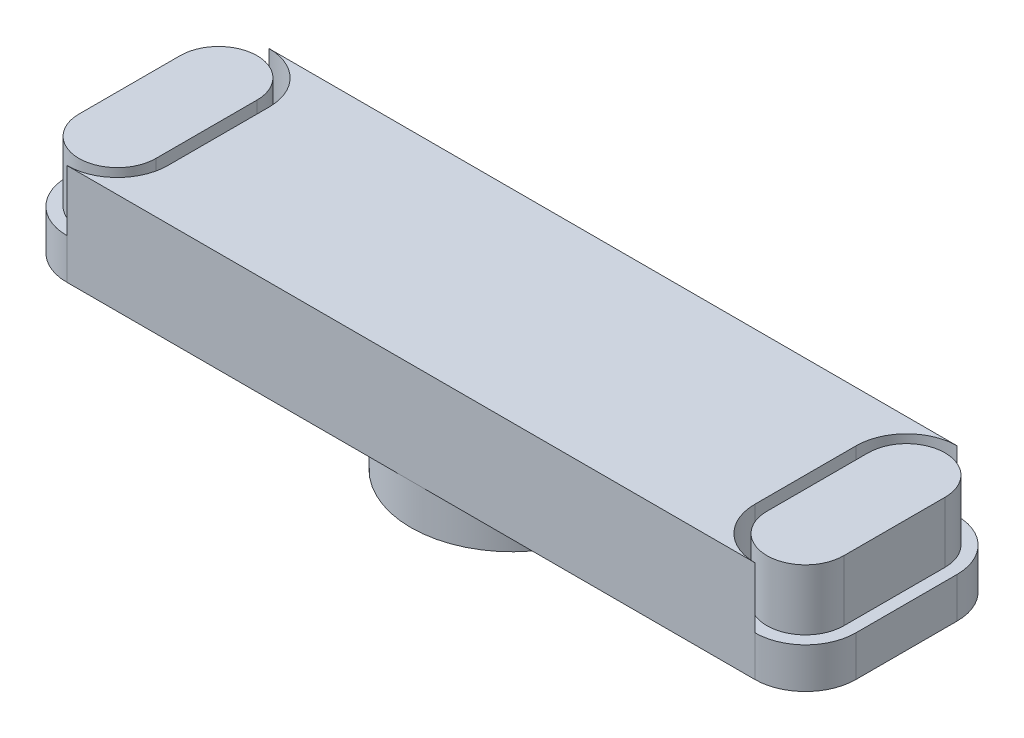
ISO-10303-21;
HEADER;
FILE_DESCRIPTION(('STEP AP214'),'2;1');
FILE_NAME('part.step','',(''),(''),'','','');
FILE_SCHEMA(('AUTOMOTIVE_DESIGN { 1 0 10303 214 1 1 1 1 }'));
ENDSEC;
DATA;
#1=APPLICATION_CONTEXT('core data for automotive mechanical design processes');
#2=APPLICATION_PROTOCOL_DEFINITION('international standard','automotive_design',2000,#1);
#3=PRODUCT_CONTEXT('',#1,'mechanical');
#4=PRODUCT('Part','Part','',(#3));
#5=PRODUCT_RELATED_PRODUCT_CATEGORY('part','',(#4));
#6=PRODUCT_DEFINITION_FORMATION('','',#4);
#7=PRODUCT_DEFINITION_CONTEXT('part definition',#1,'design');
#8=PRODUCT_DEFINITION('design','',#6,#7);
#9=PRODUCT_DEFINITION_SHAPE('','',#8);
#10=(LENGTH_UNIT() NAMED_UNIT(*) SI_UNIT(.MILLI.,.METRE.));
#11=(NAMED_UNIT(*) PLANE_ANGLE_UNIT() SI_UNIT($,.RADIAN.));
#12=(NAMED_UNIT(*) SI_UNIT($,.STERADIAN.) SOLID_ANGLE_UNIT());
#13=UNCERTAINTY_MEASURE_WITH_UNIT(LENGTH_MEASURE(1.E-05),#10,'distance_accuracy_value','');
#14=(GEOMETRIC_REPRESENTATION_CONTEXT(3) GLOBAL_UNCERTAINTY_ASSIGNED_CONTEXT((#13)) GLOBAL_UNIT_ASSIGNED_CONTEXT((#10,
#11,#12)) REPRESENTATION_CONTEXT('',''));
#15=CARTESIAN_POINT('',(0.,0.,0.));
#16=DIRECTION('',(0.,0.,1.));
#17=DIRECTION('',(1.,0.,0.));
#18=AXIS2_PLACEMENT_3D('',#15,#16,#17);
#19=CARTESIAN_POINT('',(0.,0.,0.));
#20=DIRECTION('',(0.,1.,0.));
#21=DIRECTION('',(0.,0.,1.));
#22=AXIS2_PLACEMENT_3D('',#19,#20,#21);
#23=PLANE('',#22);
#24=DIRECTION('',(0.,0.,1.));
#25=VECTOR('',#24,1.);
#26=CARTESIAN_POINT('',(-14.5,0.,0.));
#27=LINE('',#26,#25);
#28=CARTESIAN_POINT('',(-14.5,0.,-2.5));
#29=VERTEX_POINT('',#28);
#30=CARTESIAN_POINT('',(-14.5,0.,2.5));
#31=VERTEX_POINT('',#30);
#32=EDGE_CURVE('E204',#29,#31,#27,.T.);
#33=ORIENTED_EDGE('',*,*,#32,.T.);
#34=CARTESIAN_POINT('',(-17.,0.,2.49999999999999));
#35=DIRECTION('',(0.,1.,0.));
#36=DIRECTION('',(0.,0.,1.));
#37=AXIS2_PLACEMENT_3D('',#34,#35,#36);
#38=CIRCLE('',#37,2.50000000000001);
#39=CARTESIAN_POINT('',(-17.,0.,5.));
#40=VERTEX_POINT('',#39);
#41=EDGE_CURVE('E252',#31,#40,#38,.F.);
#42=ORIENTED_EDGE('',*,*,#41,.T.);
#43=DIRECTION('',(1.,0.,0.));
#44=VECTOR('',#43,1.);
#45=CARTESIAN_POINT('',(0.,0.,5.));
#46=LINE('',#45,#44);
#47=CARTESIAN_POINT('',(17.,0.,5.));
#48=VERTEX_POINT('',#47);
#49=EDGE_CURVE('E413',#40,#48,#46,.T.);
#50=ORIENTED_EDGE('',*,*,#49,.T.);
#51=CARTESIAN_POINT('',(17.,0.,2.5));
#52=DIRECTION('',(0.,1.,0.));
#53=DIRECTION('',(0.,0.,1.));
#54=AXIS2_PLACEMENT_3D('',#51,#52,#53);
#55=CIRCLE('',#54,2.50000000000001);
#56=CARTESIAN_POINT('',(14.5,0.,2.5));
#57=VERTEX_POINT('',#56);
#58=EDGE_CURVE('E50',#48,#57,#55,.F.);
#59=ORIENTED_EDGE('',*,*,#58,.T.);
#60=DIRECTION('',(0.,0.,1.));
#61=VECTOR('',#60,1.);
#62=CARTESIAN_POINT('',(14.5,0.,0.));
#63=LINE('',#62,#61);
#64=CARTESIAN_POINT('',(14.5,0.,-2.49999999999999));
#65=VERTEX_POINT('',#64);
#66=EDGE_CURVE('E272',#65,#57,#63,.T.);
#67=ORIENTED_EDGE('',*,*,#66,.F.);
#68=CARTESIAN_POINT('',(17.,0.,-2.49999999999999));
#69=DIRECTION('',(0.,1.,0.));
#70=DIRECTION('',(0.,0.,1.));
#71=AXIS2_PLACEMENT_3D('',#68,#69,#70);
#72=CIRCLE('',#71,2.50000000000001);
#73=CARTESIAN_POINT('',(17.,0.,-5.));
#74=VERTEX_POINT('',#73);
#75=EDGE_CURVE('E378',#74,#65,#72,.T.);
#76=ORIENTED_EDGE('',*,*,#75,.F.);
#77=DIRECTION('',(1.,0.,0.));
#78=VECTOR('',#77,1.);
#79=CARTESIAN_POINT('',(0.,0.,-5.));
#80=LINE('',#79,#78);
#81=CARTESIAN_POINT('',(-17.,0.,-4.99999999999999));
#82=VERTEX_POINT('',#81);
#83=EDGE_CURVE('E384',#82,#74,#80,.T.);
#84=ORIENTED_EDGE('',*,*,#83,.F.);
#85=CARTESIAN_POINT('',(-17.,0.,-2.5));
#86=DIRECTION('',(0.,1.,0.));
#87=DIRECTION('',(0.,0.,1.));
#88=AXIS2_PLACEMENT_3D('',#85,#86,#87);
#89=CIRCLE('',#88,2.5);
#90=EDGE_CURVE('E249',#29,#82,#89,.T.);
#91=ORIENTED_EDGE('',*,*,#90,.F.);
#92=EDGE_LOOP('',(#33,#42,#50,#59,#67,#76,#84,#91));
#93=FACE_BOUND('',#92,.T.);
#94=ADVANCED_FACE('F41',(#93),#23,.T.);
#95=CARTESIAN_POINT('',(-19.5,-5.,0.));
#96=DIRECTION('',(1.,0.,0.));
#97=DIRECTION('',(0.,0.,-1.));
#98=AXIS2_PLACEMENT_3D('',#95,#96,#97);
#99=PLANE('',#98);
#100=DIRECTION('',(0.,0.,-1.));
#101=VECTOR('',#100,1.);
#102=CARTESIAN_POINT('',(-19.5,-3.,0.));
#103=LINE('',#102,#101);
#104=CARTESIAN_POINT('',(-19.5,-3.,2.5));
#105=VERTEX_POINT('',#104);
#106=CARTESIAN_POINT('',(-19.5,-3.,-2.5));
#107=VERTEX_POINT('',#106);
#108=EDGE_CURVE('E64',#105,#107,#103,.T.);
#109=ORIENTED_EDGE('',*,*,#108,.T.);
#110=DIRECTION('',(0.,1.,0.));
#111=VECTOR('',#110,1.);
#112=CARTESIAN_POINT('',(-19.5,-5.,-2.5));
#113=LINE('',#112,#111);
#114=CARTESIAN_POINT('',(-19.5,-5.,-2.5));
#115=VERTEX_POINT('',#114);
#116=EDGE_CURVE('E379',#115,#107,#113,.T.);
#117=ORIENTED_EDGE('',*,*,#116,.F.);
#118=DIRECTION('',(0.,0.,-1.));
#119=VECTOR('',#118,1.);
#120=CARTESIAN_POINT('',(-19.5,-5.,0.));
#121=LINE('',#120,#119);
#122=CARTESIAN_POINT('',(-19.5,-5.,2.5));
#123=VERTEX_POINT('',#122);
#124=EDGE_CURVE('E380',#123,#115,#121,.T.);
#125=ORIENTED_EDGE('',*,*,#124,.F.);
#126=DIRECTION('',(0.,1.,0.));
#127=VECTOR('',#126,1.);
#128=CARTESIAN_POINT('',(-19.5,-5.,2.5));
#129=LINE('',#128,#127);
#130=EDGE_CURVE('E412',#123,#105,#129,.T.);
#131=ORIENTED_EDGE('',*,*,#130,.T.);
#132=EDGE_LOOP('',(#109,#117,#125,#131));
#133=FACE_BOUND('',#132,.T.);
#134=ADVANCED_FACE('F43',(#133),#99,.F.);
#135=CARTESIAN_POINT('',(-17.,-5.,-2.5));
#136=DIRECTION('',(0.,1.,0.));
#137=DIRECTION('',(0.,0.,1.));
#138=AXIS2_PLACEMENT_3D('',#135,#136,#137);
#139=CYLINDRICAL_SURFACE('',#138,2.5);
#140=ORIENTED_EDGE('',*,*,#116,.T.);
#141=CARTESIAN_POINT('',(-17.,-3.,-2.5));
#142=DIRECTION('',(0.,1.,0.));
#143=DIRECTION('',(0.,0.,1.));
#144=AXIS2_PLACEMENT_3D('',#141,#142,#143);
#145=CIRCLE('',#144,2.5);
#146=CARTESIAN_POINT('',(-17.,-3.,-4.99999999999999));
#147=VERTEX_POINT('',#146);
#148=EDGE_CURVE('E220',#147,#107,#145,.T.);
#149=ORIENTED_EDGE('',*,*,#148,.F.);
#150=DIRECTION('',(0.,1.,0.));
#151=VECTOR('',#150,1.);
#152=CARTESIAN_POINT('',(-17.,-5.,-4.99999999999999));
#153=LINE('',#152,#151);
#154=CARTESIAN_POINT('',(-17.,-5.,-4.99999999999999));
#155=VERTEX_POINT('',#154);
#156=EDGE_CURVE('E423',#155,#147,#153,.T.);
#157=ORIENTED_EDGE('',*,*,#156,.F.);
#158=CARTESIAN_POINT('',(-17.,-5.,-2.5));
#159=DIRECTION('',(0.,1.,0.));
#160=DIRECTION('',(0.,0.,1.));
#161=AXIS2_PLACEMENT_3D('',#158,#159,#160);
#162=CIRCLE('',#161,2.5);
#163=EDGE_CURVE('E408',#155,#115,#162,.T.);
#164=ORIENTED_EDGE('',*,*,#163,.T.);
#165=EDGE_LOOP('',(#140,#149,#157,#164));
#166=FACE_BOUND('',#165,.T.);
#167=ADVANCED_FACE('F524',(#166),#139,.T.);
#168=CARTESIAN_POINT('',(-17.,-5.,2.49999999999999));
#169=DIRECTION('',(0.,1.,0.));
#170=DIRECTION('',(0.,0.,1.));
#171=AXIS2_PLACEMENT_3D('',#168,#169,#170);
#172=CYLINDRICAL_SURFACE('',#171,2.50000000000001);
#173=CARTESIAN_POINT('',(-17.,-3.,2.49999999999999));
#174=DIRECTION('',(0.,1.,0.));
#175=DIRECTION('',(0.,0.,1.));
#176=AXIS2_PLACEMENT_3D('',#173,#174,#175);
#177=CIRCLE('',#176,2.50000000000001);
#178=CARTESIAN_POINT('',(-17.,-3.,5.));
#179=VERTEX_POINT('',#178);
#180=EDGE_CURVE('E11',#105,#179,#177,.T.);
#181=ORIENTED_EDGE('',*,*,#180,.F.);
#182=ORIENTED_EDGE('',*,*,#130,.F.);
#183=CARTESIAN_POINT('',(-17.,-5.,2.49999999999999));
#184=DIRECTION('',(0.,1.,0.));
#185=DIRECTION('',(0.,0.,1.));
#186=AXIS2_PLACEMENT_3D('',#183,#184,#185);
#187=CIRCLE('',#186,2.50000000000001);
#188=CARTESIAN_POINT('',(-17.,-5.,5.00000000000001));
#189=VERTEX_POINT('',#188);
#190=EDGE_CURVE('E383',#189,#123,#187,.F.);
#191=ORIENTED_EDGE('',*,*,#190,.F.);
#192=DIRECTION('',(0.,1.,0.));
#193=VECTOR('',#192,1.);
#194=CARTESIAN_POINT('',(-17.,-5.,5.00000000000001));
#195=LINE('',#194,#193);
#196=EDGE_CURVE('E443',#189,#179,#195,.T.);
#197=ORIENTED_EDGE('',*,*,#196,.T.);
#198=EDGE_LOOP('',(#181,#182,#191,#197));
#199=FACE_BOUND('',#198,.T.);
#200=ADVANCED_FACE('F597',(#199),#172,.T.);
#201=CARTESIAN_POINT('',(17.,-5.,-2.5));
#202=DIRECTION('',(0.,1.,0.));
#203=DIRECTION('',(0.,0.,1.));
#204=AXIS2_PLACEMENT_3D('',#201,#202,#203);
#205=CYLINDRICAL_SURFACE('',#204,2.50000000000001);
#206=CARTESIAN_POINT('',(17.,-3.,-2.49999999999999));
#207=DIRECTION('',(0.,1.,0.));
#208=DIRECTION('',(0.,0.,1.));
#209=AXIS2_PLACEMENT_3D('',#206,#207,#208);
#210=CIRCLE('',#209,2.50000000000001);
#211=CARTESIAN_POINT('',(19.5,-3.,-2.49999999999999));
#212=VERTEX_POINT('',#211);
#213=CARTESIAN_POINT('',(17.,-3.,-5.));
#214=VERTEX_POINT('',#213);
#215=EDGE_CURVE('E293',#212,#214,#210,.T.);
#216=ORIENTED_EDGE('',*,*,#215,.F.);
#217=DIRECTION('',(0.,1.,0.));
#218=VECTOR('',#217,1.);
#219=CARTESIAN_POINT('',(19.5,-5.,-2.49999999999999));
#220=LINE('',#219,#218);
#221=CARTESIAN_POINT('',(19.5,-5.,-2.49999999999999));
#222=VERTEX_POINT('',#221);
#223=EDGE_CURVE('E431',#222,#212,#220,.T.);
#224=ORIENTED_EDGE('',*,*,#223,.F.);
#225=CARTESIAN_POINT('',(17.,-5.,-2.5));
#226=DIRECTION('',(0.,1.,0.));
#227=DIRECTION('',(0.,0.,1.));
#228=AXIS2_PLACEMENT_3D('',#225,#226,#227);
#229=CIRCLE('',#228,2.50000000000001);
#230=CARTESIAN_POINT('',(17.,-5.,-5.));
#231=VERTEX_POINT('',#230);
#232=EDGE_CURVE('E400',#231,#222,#229,.F.);
#233=ORIENTED_EDGE('',*,*,#232,.F.);
#234=DIRECTION('',(0.,1.,0.));
#235=VECTOR('',#234,1.);
#236=CARTESIAN_POINT('',(17.,-5.,-5.));
#237=LINE('',#236,#235);
#238=EDGE_CURVE('E427',#231,#214,#237,.T.);
#239=ORIENTED_EDGE('',*,*,#238,.T.);
#240=EDGE_LOOP('',(#216,#224,#233,#239));
#241=FACE_BOUND('',#240,.T.);
#242=ADVANCED_FACE('F482',(#241),#205,.T.);
#243=CARTESIAN_POINT('',(19.5,-5.,0.));
#244=DIRECTION('',(1.,0.,0.));
#245=DIRECTION('',(0.,0.,-1.));
#246=AXIS2_PLACEMENT_3D('',#243,#244,#245);
#247=PLANE('',#246);
#248=ORIENTED_EDGE('',*,*,#223,.T.);
#249=DIRECTION('',(0.,0.,-1.));
#250=VECTOR('',#249,1.);
#251=CARTESIAN_POINT('',(19.5,-3.,0.));
#252=LINE('',#251,#250);
#253=CARTESIAN_POINT('',(19.5,-3.,2.5));
#254=VERTEX_POINT('',#253);
#255=EDGE_CURVE('E288',#254,#212,#252,.T.);
#256=ORIENTED_EDGE('',*,*,#255,.F.);
#257=DIRECTION('',(0.,1.,0.));
#258=VECTOR('',#257,1.);
#259=CARTESIAN_POINT('',(19.5,-5.,2.5));
#260=LINE('',#259,#258);
#261=CARTESIAN_POINT('',(19.5,-5.,2.5));
#262=VERTEX_POINT('',#261);
#263=EDGE_CURVE('E435',#262,#254,#260,.T.);
#264=ORIENTED_EDGE('',*,*,#263,.F.);
#265=DIRECTION('',(0.,0.,-1.));
#266=VECTOR('',#265,1.);
#267=CARTESIAN_POINT('',(19.5,-5.,0.));
#268=LINE('',#267,#266);
#269=EDGE_CURVE('E396',#262,#222,#268,.T.);
#270=ORIENTED_EDGE('',*,*,#269,.T.);
#271=EDGE_LOOP('',(#248,#256,#264,#270));
#272=FACE_BOUND('',#271,.T.);
#273=ADVANCED_FACE('F478',(#272),#247,.T.);
#274=CARTESIAN_POINT('',(17.,-5.,2.5));
#275=DIRECTION('',(0.,1.,0.));
#276=DIRECTION('',(0.,0.,1.));
#277=AXIS2_PLACEMENT_3D('',#274,#275,#276);
#278=CYLINDRICAL_SURFACE('',#277,2.50000000000001);
#279=CARTESIAN_POINT('',(17.,-3.,2.5));
#280=DIRECTION('',(0.,1.,0.));
#281=DIRECTION('',(0.,0.,1.));
#282=AXIS2_PLACEMENT_3D('',#279,#280,#281);
#283=CIRCLE('',#282,2.50000000000001);
#284=CARTESIAN_POINT('',(17.,-3.,5.));
#285=VERTEX_POINT('',#284);
#286=EDGE_CURVE('E284',#254,#285,#283,.F.);
#287=ORIENTED_EDGE('',*,*,#286,.T.);
#288=DIRECTION('',(0.,1.,0.));
#289=VECTOR('',#288,1.);
#290=CARTESIAN_POINT('',(17.,-5.,5.));
#291=LINE('',#290,#289);
#292=CARTESIAN_POINT('',(17.,-5.,5.));
#293=VERTEX_POINT('',#292);
#294=EDGE_CURVE('E439',#293,#285,#291,.T.);
#295=ORIENTED_EDGE('',*,*,#294,.F.);
#296=CARTESIAN_POINT('',(17.,-5.,2.5));
#297=DIRECTION('',(0.,1.,0.));
#298=DIRECTION('',(0.,0.,1.));
#299=AXIS2_PLACEMENT_3D('',#296,#297,#298);
#300=CIRCLE('',#299,2.50000000000001);
#301=EDGE_CURVE('E392',#262,#293,#300,.F.);
#302=ORIENTED_EDGE('',*,*,#301,.F.);
#303=ORIENTED_EDGE('',*,*,#263,.T.);
#304=EDGE_LOOP('',(#287,#295,#302,#303));
#305=FACE_BOUND('',#304,.T.);
#306=ADVANCED_FACE('F470',(#305),#278,.T.);
#307=CARTESIAN_POINT('',(0.,-5.,0.));
#308=DIRECTION('',(0.,1.,0.));
#309=DIRECTION('',(0.,0.,1.));
#310=AXIS2_PLACEMENT_3D('',#307,#308,#309);
#311=PLANE('',#310);
#312=DIRECTION('',(1.,0.,0.));
#313=VECTOR('',#312,1.);
#314=CARTESIAN_POINT('',(0.,-5.,5.));
#315=LINE('',#314,#313);
#316=CARTESIAN_POINT('',(0.,-5.,5.));
#317=VERTEX_POINT('',#316);
#318=EDGE_CURVE('E387',#317,#293,#315,.T.);
#319=ORIENTED_EDGE('',*,*,#318,.F.);
#320=CARTESIAN_POINT('',(0.,-5.,0.));
#321=DIRECTION('',(0.,1.,0.));
#322=DIRECTION('',(0.,0.,1.));
#323=AXIS2_PLACEMENT_3D('',#320,#321,#322);
#324=CIRCLE('',#323,5.);
#325=CARTESIAN_POINT('',(0.,-5.,-5.));
#326=VERTEX_POINT('',#325);
#327=EDGE_CURVE('E373',#317,#326,#324,.T.);
#328=ORIENTED_EDGE('',*,*,#327,.T.);
#329=DIRECTION('',(1.,0.,0.));
#330=VECTOR('',#329,1.);
#331=CARTESIAN_POINT('',(0.,-5.,-5.));
#332=LINE('',#331,#330);
#333=EDGE_CURVE('E403',#326,#231,#332,.T.);
#334=ORIENTED_EDGE('',*,*,#333,.T.);
#335=ORIENTED_EDGE('',*,*,#232,.T.);
#336=ORIENTED_EDGE('',*,*,#269,.F.);
#337=ORIENTED_EDGE('',*,*,#301,.T.);
#338=EDGE_LOOP('',(#319,#328,#334,#335,#336,#337));
#339=FACE_BOUND('',#338,.T.);
#340=ADVANCED_FACE('F614',(#339),#311,.F.);
#341=CARTESIAN_POINT('',(0.,-5.,-5.));
#342=DIRECTION('',(0.,0.,1.));
#343=DIRECTION('',(1.,0.,0.));
#344=AXIS2_PLACEMENT_3D('',#341,#342,#343);
#345=PLANE('',#344);
#346=ORIENTED_EDGE('',*,*,#333,.F.);
#347=EDGE_CURVE('E404',#155,#326,#332,.T.);
#348=ORIENTED_EDGE('',*,*,#347,.F.);
#349=ORIENTED_EDGE('',*,*,#156,.T.);
#350=EDGE_CURVE('E225',#147,#82,#153,.T.);
#351=ORIENTED_EDGE('',*,*,#350,.T.);
#352=ORIENTED_EDGE('',*,*,#83,.T.);
#353=DIRECTION('',(0.,1.,0.));
#354=VECTOR('',#353,1.);
#355=CARTESIAN_POINT('',(17.,-3.,-5.));
#356=LINE('',#355,#354);
#357=EDGE_CURVE('E338',#214,#74,#356,.T.);
#358=ORIENTED_EDGE('',*,*,#357,.F.);
#359=ORIENTED_EDGE('',*,*,#238,.F.);
#360=EDGE_LOOP('',(#346,#348,#349,#351,#352,#358,#359));
#361=FACE_BOUND('',#360,.T.);
#362=ADVANCED_FACE('F488',(#361),#345,.F.);
#363=CARTESIAN_POINT('',(0.,-5.,5.));
#364=DIRECTION('',(0.,0.,1.));
#365=DIRECTION('',(1.,0.,0.));
#366=AXIS2_PLACEMENT_3D('',#363,#364,#365);
#367=PLANE('',#366);
#368=ORIENTED_EDGE('',*,*,#294,.T.);
#369=DIRECTION('',(0.,1.,0.));
#370=VECTOR('',#369,1.);
#371=CARTESIAN_POINT('',(17.,-3.,5.));
#372=LINE('',#371,#370);
#373=EDGE_CURVE('E358',#48,#285,#372,.F.);
#374=ORIENTED_EDGE('',*,*,#373,.F.);
#375=ORIENTED_EDGE('',*,*,#49,.F.);
#376=EDGE_CURVE('E447',#179,#40,#195,.T.);
#377=ORIENTED_EDGE('',*,*,#376,.F.);
#378=ORIENTED_EDGE('',*,*,#196,.F.);
#379=EDGE_CURVE('E388',#189,#317,#315,.T.);
#380=ORIENTED_EDGE('',*,*,#379,.T.);
#381=ORIENTED_EDGE('',*,*,#318,.T.);
#382=EDGE_LOOP('',(#368,#374,#375,#377,#378,#380,#381));
#383=FACE_BOUND('',#382,.T.);
#384=ADVANCED_FACE('F464',(#383),#367,.T.);
#385=ORIENTED_EDGE('',*,*,#347,.T.);
#386=EDGE_CURVE('E369',#326,#317,#324,.T.);
#387=ORIENTED_EDGE('',*,*,#386,.T.);
#388=ORIENTED_EDGE('',*,*,#379,.F.);
#389=ORIENTED_EDGE('',*,*,#190,.T.);
#390=ORIENTED_EDGE('',*,*,#124,.T.);
#391=ORIENTED_EDGE('',*,*,#163,.F.);
#392=EDGE_LOOP('',(#385,#387,#388,#389,#390,#391));
#393=FACE_BOUND('',#392,.T.);
#394=ADVANCED_FACE('F626',(#393),#311,.F.);
#395=CARTESIAN_POINT('',(0.,-7.,0.));
#396=DIRECTION('',(0.,1.,0.));
#397=DIRECTION('',(0.,0.,1.));
#398=AXIS2_PLACEMENT_3D('',#395,#396,#397);
#399=CYLINDRICAL_SURFACE('',#398,3.5);
#400=CARTESIAN_POINT('',(0.,-7.,0.));
#401=DIRECTION('',(0.,1.,0.));
#402=DIRECTION('',(0.,0.,1.));
#403=AXIS2_PLACEMENT_3D('',#400,#401,#402);
#404=CIRCLE('',#403,3.5);
#405=CARTESIAN_POINT('',(0.,-7.,3.5));
#406=VERTEX_POINT('',#405);
#407=EDGE_CURVE('E361',#406,#406,#404,.T.);
#408=ORIENTED_EDGE('',*,*,#407,.F.);
#409=EDGE_LOOP('',(#408));
#410=FACE_BOUND('',#409,.T.);
#411=CARTESIAN_POINT('',(0.,-5.,0.));
#412=DIRECTION('',(0.,1.,0.));
#413=DIRECTION('',(0.,0.,1.));
#414=AXIS2_PLACEMENT_3D('',#411,#412,#413);
#415=CIRCLE('',#414,3.5);
#416=CARTESIAN_POINT('',(0.,-5.,3.5));
#417=VERTEX_POINT('',#416);
#418=EDGE_CURVE('E374',#417,#417,#415,.T.);
#419=ORIENTED_EDGE('',*,*,#418,.T.);
#420=EDGE_LOOP('',(#419));
#421=FACE_BOUND('',#420,.T.);
#422=ADVANCED_FACE('F839',(#410,#421),#399,.F.);
#423=CARTESIAN_POINT('',(0.,-7.,0.));
#424=DIRECTION('',(0.,1.,0.));
#425=DIRECTION('',(0.,0.,1.));
#426=AXIS2_PLACEMENT_3D('',#423,#424,#425);
#427=CYLINDRICAL_SURFACE('',#426,5.);
#428=CARTESIAN_POINT('',(0.,-7.,0.));
#429=DIRECTION('',(0.,1.,0.));
#430=DIRECTION('',(0.,0.,1.));
#431=AXIS2_PLACEMENT_3D('',#428,#429,#430);
#432=CIRCLE('',#431,5.);
#433=CARTESIAN_POINT('',(0.,-7.,5.));
#434=VERTEX_POINT('',#433);
#435=EDGE_CURVE('E365',#434,#434,#432,.T.);
#436=ORIENTED_EDGE('',*,*,#435,.T.);
#437=EDGE_LOOP('',(#436));
#438=FACE_BOUND('',#437,.T.);
#439=ORIENTED_EDGE('',*,*,#327,.F.);
#440=ORIENTED_EDGE('',*,*,#386,.F.);
#441=EDGE_LOOP('',(#439,#440));
#442=FACE_BOUND('',#441,.T.);
#443=ADVANCED_FACE('F836',(#438,#442),#427,.T.);
#444=CARTESIAN_POINT('',(0.,-7.,0.));
#445=DIRECTION('',(0.,1.,0.));
#446=DIRECTION('',(0.,0.,1.));
#447=AXIS2_PLACEMENT_3D('',#444,#445,#446);
#448=PLANE('',#447);
#449=ORIENTED_EDGE('',*,*,#407,.T.);
#450=EDGE_LOOP('',(#449));
#451=FACE_BOUND('',#450,.T.);
#452=ORIENTED_EDGE('',*,*,#435,.F.);
#453=EDGE_LOOP('',(#452));
#454=FACE_BOUND('',#453,.T.);
#455=ADVANCED_FACE('F838',(#451,#454),#448,.F.);
#456=ORIENTED_EDGE('',*,*,#418,.F.);
#457=EDGE_LOOP('',(#456));
#458=FACE_BOUND('',#457,.T.);
#459=ADVANCED_FACE('F846',(#458),#311,.F.);
#460=CARTESIAN_POINT('',(17.,-3.,2.5));
#461=DIRECTION('',(0.,1.,0.));
#462=DIRECTION('',(0.,0.,1.));
#463=AXIS2_PLACEMENT_3D('',#460,#461,#462);
#464=CYLINDRICAL_SURFACE('',#463,2.50000000000001);
#465=ORIENTED_EDGE('',*,*,#373,.T.);
#466=CARTESIAN_POINT('',(14.5,-3.,2.5));
#467=VERTEX_POINT('',#466);
#468=EDGE_CURVE('E289',#285,#467,#283,.F.);
#469=ORIENTED_EDGE('',*,*,#468,.T.);
#470=DIRECTION('',(0.,1.,0.));
#471=VECTOR('',#470,1.);
#472=CARTESIAN_POINT('',(14.5,-3.,2.5));
#473=LINE('',#472,#471);
#474=EDGE_CURVE('E350',#467,#57,#473,.T.);
#475=ORIENTED_EDGE('',*,*,#474,.T.);
#476=ORIENTED_EDGE('',*,*,#58,.F.);
#477=EDGE_LOOP('',(#465,#469,#475,#476));
#478=FACE_BOUND('',#477,.T.);
#479=ADVANCED_FACE('F460',(#478),#464,.F.);
#480=CARTESIAN_POINT('',(18.9,-3.,0.));
#481=DIRECTION('',(-1.,0.,0.));
#482=DIRECTION('',(0.,0.,1.));
#483=AXIS2_PLACEMENT_3D('',#480,#481,#482);
#484=PLANE('',#483);
#485=DIRECTION('',(0.,0.,1.));
#486=VECTOR('',#485,1.);
#487=CARTESIAN_POINT('',(18.9,0.,0.));
#488=LINE('',#487,#486);
#489=CARTESIAN_POINT('',(18.9,0.,-2.49999999999999));
#490=VERTEX_POINT('',#489);
#491=CARTESIAN_POINT('',(18.9,0.,2.5));
#492=VERTEX_POINT('',#491);
#493=EDGE_CURVE('E320',#490,#492,#488,.T.);
#494=ORIENTED_EDGE('',*,*,#493,.T.);
#495=DIRECTION('',(0.,1.,0.));
#496=VECTOR('',#495,1.);
#497=CARTESIAN_POINT('',(18.9,-3.,2.5));
#498=LINE('',#497,#496);
#499=CARTESIAN_POINT('',(18.9,-3.,2.5));
#500=VERTEX_POINT('',#499);
#501=EDGE_CURVE('E346',#500,#492,#498,.T.);
#502=ORIENTED_EDGE('',*,*,#501,.F.);
#503=DIRECTION('',(0.,0.,1.));
#504=VECTOR('',#503,1.);
#505=CARTESIAN_POINT('',(18.9,-3.,0.));
#506=LINE('',#505,#504);
#507=CARTESIAN_POINT('',(18.9,-3.,-2.49999999999999));
#508=VERTEX_POINT('',#507);
#509=EDGE_CURVE('E301',#508,#500,#506,.T.);
#510=ORIENTED_EDGE('',*,*,#509,.F.);
#511=DIRECTION('',(0.,1.,0.));
#512=VECTOR('',#511,1.);
#513=CARTESIAN_POINT('',(18.9,-3.,-2.49999999999999));
#514=LINE('',#513,#512);
#515=EDGE_CURVE('E335',#508,#490,#514,.T.);
#516=ORIENTED_EDGE('',*,*,#515,.T.);
#517=EDGE_LOOP('',(#494,#502,#510,#516));
#518=FACE_BOUND('',#517,.T.);
#519=ADVANCED_FACE('F543',(#518),#484,.F.);
#520=CARTESIAN_POINT('',(17.,-3.,-2.5));
#521=DIRECTION('',(0.,1.,0.));
#522=DIRECTION('',(0.,0.,1.));
#523=AXIS2_PLACEMENT_3D('',#520,#521,#522);
#524=CYLINDRICAL_SURFACE('',#523,1.9);
#525=CARTESIAN_POINT('',(17.,0.,-2.5));
#526=DIRECTION('',(0.,1.,0.));
#527=DIRECTION('',(0.,0.,1.));
#528=AXIS2_PLACEMENT_3D('',#525,#526,#527);
#529=CIRCLE('',#528,1.9);
#530=CARTESIAN_POINT('',(15.1,0.,-2.49999999999999));
#531=VERTEX_POINT('',#530);
#532=EDGE_CURVE('E331',#531,#490,#529,.F.);
#533=ORIENTED_EDGE('',*,*,#532,.T.);
#534=ORIENTED_EDGE('',*,*,#515,.F.);
#535=CARTESIAN_POINT('',(17.,-3.,-2.5));
#536=DIRECTION('',(0.,1.,0.));
#537=DIRECTION('',(0.,0.,1.));
#538=AXIS2_PLACEMENT_3D('',#535,#536,#537);
#539=CIRCLE('',#538,1.9);
#540=CARTESIAN_POINT('',(15.1,-3.,-2.49999999999999));
#541=VERTEX_POINT('',#540);
#542=EDGE_CURVE('E312',#541,#508,#539,.F.);
#543=ORIENTED_EDGE('',*,*,#542,.F.);
#544=DIRECTION('',(0.,1.,0.));
#545=VECTOR('',#544,1.);
#546=CARTESIAN_POINT('',(15.1,-3.,-2.49999999999999));
#547=LINE('',#546,#545);
#548=EDGE_CURVE('E339',#541,#531,#547,.T.);
#549=ORIENTED_EDGE('',*,*,#548,.T.);
#550=EDGE_LOOP('',(#533,#534,#543,#549));
#551=FACE_BOUND('',#550,.T.);
#552=ADVANCED_FACE('F513',(#551),#524,.T.);
#553=CARTESIAN_POINT('',(15.1,-3.,0.));
#554=DIRECTION('',(-1.,0.,0.));
#555=DIRECTION('',(0.,0.,1.));
#556=AXIS2_PLACEMENT_3D('',#553,#554,#555);
#557=PLANE('',#556);
#558=DIRECTION('',(0.,0.,1.));
#559=VECTOR('',#558,1.);
#560=CARTESIAN_POINT('',(15.1,0.,0.));
#561=LINE('',#560,#559);
#562=CARTESIAN_POINT('',(15.1,0.,2.5));
#563=VERTEX_POINT('',#562);
#564=EDGE_CURVE('E327',#531,#563,#561,.T.);
#565=ORIENTED_EDGE('',*,*,#564,.F.);
#566=ORIENTED_EDGE('',*,*,#548,.F.);
#567=DIRECTION('',(0.,0.,1.));
#568=VECTOR('',#567,1.);
#569=CARTESIAN_POINT('',(15.1,-3.,0.));
#570=LINE('',#569,#568);
#571=CARTESIAN_POINT('',(15.1,-3.,2.5));
#572=VERTEX_POINT('',#571);
#573=EDGE_CURVE('E308',#541,#572,#570,.T.);
#574=ORIENTED_EDGE('',*,*,#573,.T.);
#575=DIRECTION('',(0.,1.,0.));
#576=VECTOR('',#575,1.);
#577=CARTESIAN_POINT('',(15.1,-3.,2.5));
#578=LINE('',#577,#576);
#579=EDGE_CURVE('E342',#572,#563,#578,.T.);
#580=ORIENTED_EDGE('',*,*,#579,.T.);
#581=EDGE_LOOP('',(#565,#566,#574,#580));
#582=FACE_BOUND('',#581,.T.);
#583=ADVANCED_FACE('F505',(#582),#557,.T.);
#584=CARTESIAN_POINT('',(14.5,-3.,0.));
#585=DIRECTION('',(-1.,0.,0.));
#586=DIRECTION('',(0.,0.,1.));
#587=AXIS2_PLACEMENT_3D('',#584,#585,#586);
#588=PLANE('',#587);
#589=ORIENTED_EDGE('',*,*,#66,.T.);
#590=ORIENTED_EDGE('',*,*,#474,.F.);
#591=DIRECTION('',(0.,0.,1.));
#592=VECTOR('',#591,1.);
#593=CARTESIAN_POINT('',(14.5,-3.,0.));
#594=LINE('',#593,#592);
#595=CARTESIAN_POINT('',(14.5,-3.,-2.49999999999999));
#596=VERTEX_POINT('',#595);
#597=EDGE_CURVE('E297',#596,#467,#594,.T.);
#598=ORIENTED_EDGE('',*,*,#597,.F.);
#599=DIRECTION('',(0.,1.,0.));
#600=VECTOR('',#599,1.);
#601=CARTESIAN_POINT('',(14.5,-3.,-2.49999999999999));
#602=LINE('',#601,#600);
#603=EDGE_CURVE('E316',#596,#65,#602,.T.);
#604=ORIENTED_EDGE('',*,*,#603,.T.);
#605=EDGE_LOOP('',(#589,#590,#598,#604));
#606=FACE_BOUND('',#605,.T.);
#607=ADVANCED_FACE('F503',(#606),#588,.F.);
#608=CARTESIAN_POINT('',(17.,-3.,-2.49999999999999));
#609=DIRECTION('',(0.,1.,0.));
#610=DIRECTION('',(0.,0.,1.));
#611=AXIS2_PLACEMENT_3D('',#608,#609,#610);
#612=CYLINDRICAL_SURFACE('',#611,2.50000000000001);
#613=ORIENTED_EDGE('',*,*,#357,.T.);
#614=ORIENTED_EDGE('',*,*,#75,.T.);
#615=ORIENTED_EDGE('',*,*,#603,.F.);
#616=EDGE_CURVE('E292',#214,#596,#210,.T.);
#617=ORIENTED_EDGE('',*,*,#616,.F.);
#618=EDGE_LOOP('',(#613,#614,#615,#617));
#619=FACE_BOUND('',#618,.T.);
#620=ADVANCED_FACE('F491',(#619),#612,.F.);
#621=CARTESIAN_POINT('',(17.,-3.,2.5));
#622=DIRECTION('',(0.,1.,0.));
#623=DIRECTION('',(0.,0.,1.));
#624=AXIS2_PLACEMENT_3D('',#621,#622,#623);
#625=CYLINDRICAL_SURFACE('',#624,1.9);
#626=CARTESIAN_POINT('',(17.,0.,2.5));
#627=DIRECTION('',(0.,1.,0.));
#628=DIRECTION('',(0.,0.,1.));
#629=AXIS2_PLACEMENT_3D('',#626,#627,#628);
#630=CIRCLE('',#629,1.9);
#631=EDGE_CURVE('E323',#563,#492,#630,.T.);
#632=ORIENTED_EDGE('',*,*,#631,.F.);
#633=ORIENTED_EDGE('',*,*,#579,.F.);
#634=CARTESIAN_POINT('',(17.,-3.,2.5));
#635=DIRECTION('',(0.,1.,0.));
#636=DIRECTION('',(0.,0.,1.));
#637=AXIS2_PLACEMENT_3D('',#634,#635,#636);
#638=CIRCLE('',#637,1.9);
#639=EDGE_CURVE('E305',#572,#500,#638,.T.);
#640=ORIENTED_EDGE('',*,*,#639,.T.);
#641=ORIENTED_EDGE('',*,*,#501,.T.);
#642=EDGE_LOOP('',(#632,#633,#640,#641));
#643=FACE_BOUND('',#642,.T.);
#644=ADVANCED_FACE('F511',(#643),#625,.T.);
#645=CARTESIAN_POINT('',(0.,-3.,0.));
#646=DIRECTION('',(0.,1.,0.));
#647=DIRECTION('',(0.,0.,1.));
#648=AXIS2_PLACEMENT_3D('',#645,#646,#647);
#649=PLANE('',#648);
#650=ORIENTED_EDGE('',*,*,#286,.F.);
#651=ORIENTED_EDGE('',*,*,#255,.T.);
#652=ORIENTED_EDGE('',*,*,#215,.T.);
#653=ORIENTED_EDGE('',*,*,#616,.T.);
#654=ORIENTED_EDGE('',*,*,#597,.T.);
#655=ORIENTED_EDGE('',*,*,#468,.F.);
#656=EDGE_LOOP('',(#650,#651,#652,#653,#654,#655));
#657=FACE_BOUND('',#656,.T.);
#658=ORIENTED_EDGE('',*,*,#509,.T.);
#659=ORIENTED_EDGE('',*,*,#639,.F.);
#660=ORIENTED_EDGE('',*,*,#573,.F.);
#661=ORIENTED_EDGE('',*,*,#542,.T.);
#662=EDGE_LOOP('',(#658,#659,#660,#661));
#663=FACE_BOUND('',#662,.T.);
#664=ADVANCED_FACE('F474',(#657,#663),#649,.T.);
#665=ORIENTED_EDGE('',*,*,#493,.F.);
#666=ORIENTED_EDGE('',*,*,#532,.F.);
#667=ORIENTED_EDGE('',*,*,#564,.T.);
#668=ORIENTED_EDGE('',*,*,#631,.T.);
#669=EDGE_LOOP('',(#665,#666,#667,#668));
#670=FACE_BOUND('',#669,.T.);
#671=ADVANCED_FACE('F520',(#670),#23,.T.);
#672=CARTESIAN_POINT('',(-17.,-3.,-2.5));
#673=DIRECTION('',(0.,1.,0.));
#674=DIRECTION('',(0.,0.,1.));
#675=AXIS2_PLACEMENT_3D('',#672,#673,#674);
#676=CYLINDRICAL_SURFACE('',#675,2.5);
#677=CARTESIAN_POINT('',(-14.5,-3.,-2.5));
#678=VERTEX_POINT('',#677);
#679=EDGE_CURVE('E215',#678,#147,#145,.T.);
#680=ORIENTED_EDGE('',*,*,#679,.F.);
#681=DIRECTION('',(0.,1.,0.));
#682=VECTOR('',#681,1.);
#683=CARTESIAN_POINT('',(-14.5,-3.,-2.5));
#684=LINE('',#683,#682);
#685=EDGE_CURVE('E197',#678,#29,#684,.T.);
#686=ORIENTED_EDGE('',*,*,#685,.T.);
#687=ORIENTED_EDGE('',*,*,#90,.T.);
#688=ORIENTED_EDGE('',*,*,#350,.F.);
#689=EDGE_LOOP('',(#680,#686,#687,#688));
#690=FACE_BOUND('',#689,.T.);
#691=ADVANCED_FACE('F223',(#690),#676,.F.);
#692=CARTESIAN_POINT('',(-17.,-3.,2.49999999999999));
#693=DIRECTION('',(0.,1.,0.));
#694=DIRECTION('',(0.,0.,1.));
#695=AXIS2_PLACEMENT_3D('',#692,#693,#694);
#696=CYLINDRICAL_SURFACE('',#695,1.89999999999999);
#697=CARTESIAN_POINT('',(-17.,0.,2.49999999999999));
#698=DIRECTION('',(0.,1.,0.));
#699=DIRECTION('',(0.,0.,1.));
#700=AXIS2_PLACEMENT_3D('',#697,#698,#699);
#701=CIRCLE('',#700,1.89999999999999);
#702=CARTESIAN_POINT('',(-18.9,0.,2.5));
#703=VERTEX_POINT('',#702);
#704=CARTESIAN_POINT('',(-15.1,0.,2.5));
#705=VERTEX_POINT('',#704);
#706=EDGE_CURVE('E57',#703,#705,#701,.T.);
#707=ORIENTED_EDGE('',*,*,#706,.F.);
#708=DIRECTION('',(0.,1.,0.));
#709=VECTOR('',#708,1.);
#710=CARTESIAN_POINT('',(-18.9,-3.,2.5));
#711=LINE('',#710,#709);
#712=CARTESIAN_POINT('',(-18.9,-3.,2.5));
#713=VERTEX_POINT('',#712);
#714=EDGE_CURVE('E279',#713,#703,#711,.T.);
#715=ORIENTED_EDGE('',*,*,#714,.F.);
#716=CARTESIAN_POINT('',(-17.,-3.,2.49999999999999));
#717=DIRECTION('',(0.,1.,0.));
#718=DIRECTION('',(0.,0.,1.));
#719=AXIS2_PLACEMENT_3D('',#716,#717,#718);
#720=CIRCLE('',#719,1.89999999999999);
#721=CARTESIAN_POINT('',(-15.1,-3.,2.5));
#722=VERTEX_POINT('',#721);
#723=EDGE_CURVE('E234',#713,#722,#720,.T.);
#724=ORIENTED_EDGE('',*,*,#723,.T.);
#725=DIRECTION('',(0.,1.,0.));
#726=VECTOR('',#725,1.);
#727=CARTESIAN_POINT('',(-15.1,-3.,2.5));
#728=LINE('',#727,#726);
#729=EDGE_CURVE('E269',#722,#705,#728,.T.);
#730=ORIENTED_EDGE('',*,*,#729,.T.);
#731=EDGE_LOOP('',(#707,#715,#724,#730));
#732=FACE_BOUND('',#731,.T.);
#733=ADVANCED_FACE('F536',(#732),#696,.T.);
#734=CARTESIAN_POINT('',(-15.1,-3.,0.));
#735=DIRECTION('',(-1.,0.,0.));
#736=DIRECTION('',(0.,0.,1.));
#737=AXIS2_PLACEMENT_3D('',#734,#735,#736);
#738=PLANE('',#737);
#739=DIRECTION('',(0.,0.,1.));
#740=VECTOR('',#739,1.);
#741=CARTESIAN_POINT('',(-15.1,0.,0.));
#742=LINE('',#741,#740);
#743=CARTESIAN_POINT('',(-15.1,0.,-2.49999999999999));
#744=VERTEX_POINT('',#743);
#745=EDGE_CURVE('E221',#744,#705,#742,.T.);
#746=ORIENTED_EDGE('',*,*,#745,.T.);
#747=ORIENTED_EDGE('',*,*,#729,.F.);
#748=DIRECTION('',(0.,0.,1.));
#749=VECTOR('',#748,1.);
#750=CARTESIAN_POINT('',(-15.1,-3.,0.));
#751=LINE('',#750,#749);
#752=CARTESIAN_POINT('',(-15.1,-3.,-2.49999999999999));
#753=VERTEX_POINT('',#752);
#754=EDGE_CURVE('E210',#753,#722,#751,.T.);
#755=ORIENTED_EDGE('',*,*,#754,.F.);
#756=DIRECTION('',(0.,1.,0.));
#757=VECTOR('',#756,1.);
#758=CARTESIAN_POINT('',(-15.1,-3.,-2.49999999999999));
#759=LINE('',#758,#757);
#760=EDGE_CURVE('E273',#753,#744,#759,.T.);
#761=ORIENTED_EDGE('',*,*,#760,.T.);
#762=EDGE_LOOP('',(#746,#747,#755,#761));
#763=FACE_BOUND('',#762,.T.);
#764=ADVANCED_FACE('F643',(#763),#738,.F.);
#765=CARTESIAN_POINT('',(-17.,-3.,-2.49999999999999));
#766=DIRECTION('',(0.,1.,0.));
#767=DIRECTION('',(0.,0.,1.));
#768=AXIS2_PLACEMENT_3D('',#765,#766,#767);
#769=CYLINDRICAL_SURFACE('',#768,1.89999999999999);
#770=CARTESIAN_POINT('',(-17.,0.,-2.49999999999999));
#771=DIRECTION('',(0.,1.,0.));
#772=DIRECTION('',(0.,0.,1.));
#773=AXIS2_PLACEMENT_3D('',#770,#771,#772);
#774=CIRCLE('',#773,1.89999999999999);
#775=CARTESIAN_POINT('',(-18.9,0.,-2.5));
#776=VERTEX_POINT('',#775);
#777=EDGE_CURVE('E262',#776,#744,#774,.F.);
#778=ORIENTED_EDGE('',*,*,#777,.T.);
#779=ORIENTED_EDGE('',*,*,#760,.F.);
#780=CARTESIAN_POINT('',(-17.,-3.,-2.49999999999999));
#781=DIRECTION('',(0.,1.,0.));
#782=DIRECTION('',(0.,0.,1.));
#783=AXIS2_PLACEMENT_3D('',#780,#781,#782);
#784=CIRCLE('',#783,1.89999999999999);
#785=CARTESIAN_POINT('',(-18.9,-3.,-2.5));
#786=VERTEX_POINT('',#785);
#787=EDGE_CURVE('E240',#786,#753,#784,.F.);
#788=ORIENTED_EDGE('',*,*,#787,.F.);
#789=DIRECTION('',(0.,1.,0.));
#790=VECTOR('',#789,1.);
#791=CARTESIAN_POINT('',(-18.9,-3.,-2.5));
#792=LINE('',#791,#790);
#793=EDGE_CURVE('E276',#786,#776,#792,.T.);
#794=ORIENTED_EDGE('',*,*,#793,.T.);
#795=EDGE_LOOP('',(#778,#779,#788,#794));
#796=FACE_BOUND('',#795,.T.);
#797=ADVANCED_FACE('F652',(#796),#769,.T.);
#798=CARTESIAN_POINT('',(-14.5,-3.,0.));
#799=DIRECTION('',(-1.,0.,0.));
#800=DIRECTION('',(0.,0.,1.));
#801=AXIS2_PLACEMENT_3D('',#798,#799,#800);
#802=PLANE('',#801);
#803=ORIENTED_EDGE('',*,*,#32,.F.);
#804=ORIENTED_EDGE('',*,*,#685,.F.);
#805=DIRECTION('',(0.,0.,1.));
#806=VECTOR('',#805,1.);
#807=CARTESIAN_POINT('',(-14.5,-3.,0.));
#808=LINE('',#807,#806);
#809=CARTESIAN_POINT('',(-14.5,-3.,2.5));
#810=VERTEX_POINT('',#809);
#811=EDGE_CURVE('E201',#678,#810,#808,.T.);
#812=ORIENTED_EDGE('',*,*,#811,.T.);
#813=DIRECTION('',(0.,1.,0.));
#814=VECTOR('',#813,1.);
#815=CARTESIAN_POINT('',(-14.5,-3.,2.5));
#816=LINE('',#815,#814);
#817=EDGE_CURVE('E209',#810,#31,#816,.T.);
#818=ORIENTED_EDGE('',*,*,#817,.T.);
#819=EDGE_LOOP('',(#803,#804,#812,#818));
#820=FACE_BOUND('',#819,.T.);
#821=ADVANCED_FACE('F199',(#820),#802,.T.);
#822=CARTESIAN_POINT('',(-17.,-3.,2.49999999999999));
#823=DIRECTION('',(0.,1.,0.));
#824=DIRECTION('',(0.,0.,1.));
#825=AXIS2_PLACEMENT_3D('',#822,#823,#824);
#826=CYLINDRICAL_SURFACE('',#825,2.50000000000001);
#827=ORIENTED_EDGE('',*,*,#41,.F.);
#828=ORIENTED_EDGE('',*,*,#817,.F.);
#829=CARTESIAN_POINT('',(-17.,-3.,2.49999999999999));
#830=DIRECTION('',(0.,1.,0.));
#831=DIRECTION('',(0.,0.,1.));
#832=AXIS2_PLACEMENT_3D('',#829,#830,#831);
#833=CIRCLE('',#832,2.50000000000001);
#834=EDGE_CURVE('E218',#810,#179,#833,.F.);
#835=ORIENTED_EDGE('',*,*,#834,.T.);
#836=ORIENTED_EDGE('',*,*,#376,.T.);
#837=EDGE_LOOP('',(#827,#828,#835,#836));
#838=FACE_BOUND('',#837,.T.);
#839=ADVANCED_FACE('F671',(#838),#826,.F.);
#840=CARTESIAN_POINT('',(-18.9,-3.,0.));
#841=DIRECTION('',(-1.,0.,0.));
#842=DIRECTION('',(0.,0.,1.));
#843=AXIS2_PLACEMENT_3D('',#840,#841,#842);
#844=PLANE('',#843);
#845=DIRECTION('',(0.,0.,1.));
#846=VECTOR('',#845,1.);
#847=CARTESIAN_POINT('',(-18.9,0.,0.));
#848=LINE('',#847,#846);
#849=EDGE_CURVE('E258',#776,#703,#848,.T.);
#850=ORIENTED_EDGE('',*,*,#849,.F.);
#851=ORIENTED_EDGE('',*,*,#793,.F.);
#852=DIRECTION('',(0.,0.,1.));
#853=VECTOR('',#852,1.);
#854=CARTESIAN_POINT('',(-18.9,-3.,0.));
#855=LINE('',#854,#853);
#856=EDGE_CURVE('E237',#786,#713,#855,.T.);
#857=ORIENTED_EDGE('',*,*,#856,.T.);
#858=ORIENTED_EDGE('',*,*,#714,.T.);
#859=EDGE_LOOP('',(#850,#851,#857,#858));
#860=FACE_BOUND('',#859,.T.);
#861=ADVANCED_FACE('F680',(#860),#844,.T.);
#862=CARTESIAN_POINT('',(0.,-3.,0.));
#863=DIRECTION('',(0.,1.,0.));
#864=DIRECTION('',(0.,0.,1.));
#865=AXIS2_PLACEMENT_3D('',#862,#863,#864);
#866=PLANE('',#865);
#867=ORIENTED_EDGE('',*,*,#811,.F.);
#868=ORIENTED_EDGE('',*,*,#679,.T.);
#869=ORIENTED_EDGE('',*,*,#148,.T.);
#870=ORIENTED_EDGE('',*,*,#108,.F.);
#871=ORIENTED_EDGE('',*,*,#180,.T.);
#872=ORIENTED_EDGE('',*,*,#834,.F.);
#873=EDGE_LOOP('',(#867,#868,#869,#870,#871,#872));
#874=FACE_BOUND('',#873,.T.);
#875=ORIENTED_EDGE('',*,*,#723,.F.);
#876=ORIENTED_EDGE('',*,*,#856,.F.);
#877=ORIENTED_EDGE('',*,*,#787,.T.);
#878=ORIENTED_EDGE('',*,*,#754,.T.);
#879=EDGE_LOOP('',(#875,#876,#877,#878));
#880=FACE_BOUND('',#879,.T.);
#881=ADVANCED_FACE('F213',(#874,#880),#866,.T.);
#882=ORIENTED_EDGE('',*,*,#849,.T.);
#883=ORIENTED_EDGE('',*,*,#706,.T.);
#884=ORIENTED_EDGE('',*,*,#745,.F.);
#885=ORIENTED_EDGE('',*,*,#777,.F.);
#886=EDGE_LOOP('',(#882,#883,#884,#885));
#887=FACE_BOUND('',#886,.T.);
#888=ADVANCED_FACE('F519',(#887),#23,.T.);
#889=CLOSED_SHELL('',(#94,#134,#167,#200,#242,#273,#306,#340,#362,#384,#394,#422,#443,#455,#459,
#479,#519,#552,#583,#607,#620,#644,#664,#671,#691,#733,#764,#797,#821,#839,#861,#881,#888));
#890=MANIFOLD_SOLID_BREP('B2',#889);
#891=ADVANCED_BREP_SHAPE_REPRESENTATION('',(#18,#890),#14);
#892=SHAPE_DEFINITION_REPRESENTATION(#9,#891);
ENDSEC;
END-ISO-10303-21;
